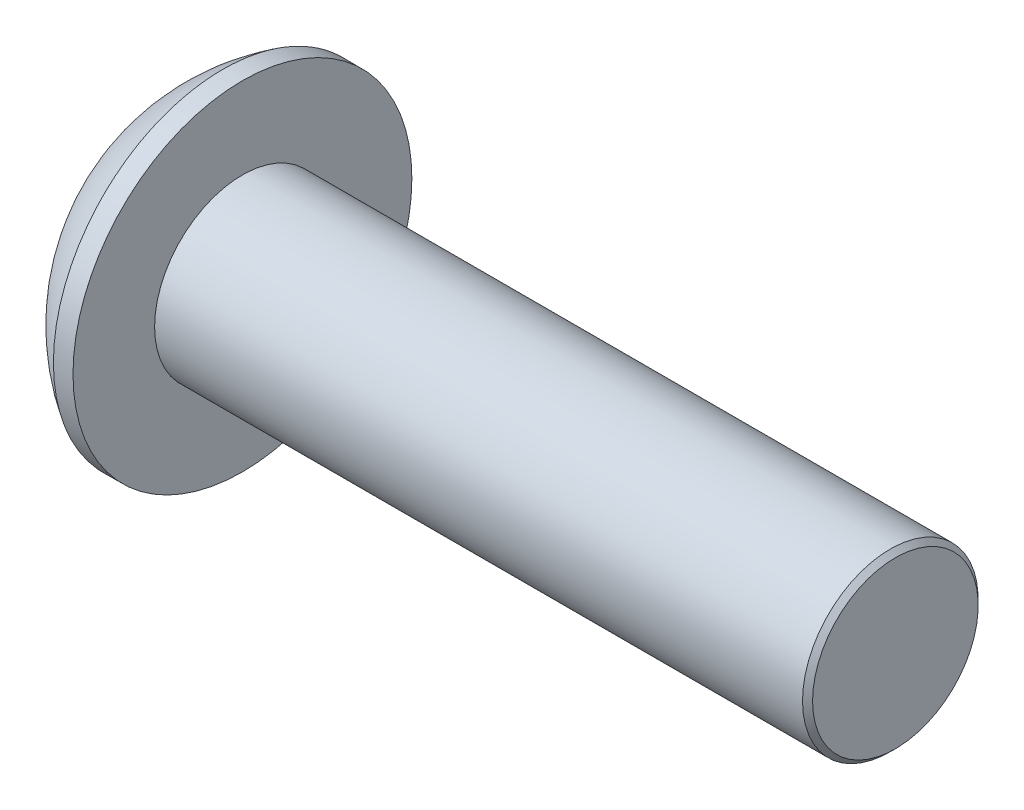
ISO-10303-21;
HEADER;
FILE_DESCRIPTION(('STEP AP214'),'2;1');
FILE_NAME('part.step','',(''),(''),'','','');
FILE_SCHEMA(('AUTOMOTIVE_DESIGN { 1 0 10303 214 1 1 1 1 }'));
ENDSEC;
DATA;
#1=APPLICATION_CONTEXT('core data for automotive mechanical design processes');
#2=APPLICATION_PROTOCOL_DEFINITION('international standard','automotive_design',2000,#1);
#3=PRODUCT_CONTEXT('',#1,'mechanical');
#4=PRODUCT('Part','Part','',(#3));
#5=PRODUCT_RELATED_PRODUCT_CATEGORY('part','',(#4));
#6=PRODUCT_DEFINITION_FORMATION('','',#4);
#7=PRODUCT_DEFINITION_CONTEXT('part definition',#1,'design');
#8=PRODUCT_DEFINITION('design','',#6,#7);
#9=PRODUCT_DEFINITION_SHAPE('','',#8);
#10=(LENGTH_UNIT() NAMED_UNIT(*) SI_UNIT(.MILLI.,.METRE.));
#11=(NAMED_UNIT(*) PLANE_ANGLE_UNIT() SI_UNIT($,.RADIAN.));
#12=(NAMED_UNIT(*) SI_UNIT($,.STERADIAN.) SOLID_ANGLE_UNIT());
#13=UNCERTAINTY_MEASURE_WITH_UNIT(LENGTH_MEASURE(1.E-05),#10,'distance_accuracy_value','');
#14=(GEOMETRIC_REPRESENTATION_CONTEXT(3) GLOBAL_UNCERTAINTY_ASSIGNED_CONTEXT((#13)) GLOBAL_UNIT_ASSIGNED_CONTEXT((#10,
#11,#12)) REPRESENTATION_CONTEXT('',''));
#15=CARTESIAN_POINT('',(0.,0.,0.));
#16=DIRECTION('',(0.,0.,1.));
#17=DIRECTION('',(1.,0.,0.));
#18=AXIS2_PLACEMENT_3D('',#15,#16,#17);
#19=CARTESIAN_POINT('',(1.32080000000034,0.,0.));
#20=DIRECTION('',(-1.,0.,0.));
#21=DIRECTION('',(0.,0.,1.));
#22=AXIS2_PLACEMENT_3D('',#19,#20,#21);
#23=CONICAL_SURFACE('',#22,1.1937999999998,1.04719755119608);
#24=CARTESIAN_POINT('',(2.01004075135902,0.,4.44089209850063E-13));
#25=VERTEX_POINT('',#24);
#26=VERTEX_LOOP('',#25);
#27=FACE_BOUND('',#26,.T.);
#28=CARTESIAN_POINT('',(1.32080000000009,0.,0.));
#29=DIRECTION('',(-1.,0.,0.));
#30=DIRECTION('',(0.,0.,1.));
#31=AXIS2_PLACEMENT_3D('',#28,#29,#30);
#32=CIRCLE('',#31,1.19380000000024);
#33=CARTESIAN_POINT('',(1.32080000000004,-1.03386112703797,0.59690000000006));
#34=VERTEX_POINT('',#33);
#35=CARTESIAN_POINT('',(1.32080000000004,0.,1.19380000000012));
#36=VERTEX_POINT('',#35);
#37=EDGE_CURVE('E19',#34,#36,#32,.T.);
#38=ORIENTED_EDGE('',*,*,#37,.T.);
#39=CARTESIAN_POINT('',(1.32080000000009,0.,0.));
#40=DIRECTION('',(-1.,0.,0.));
#41=DIRECTION('',(0.,0.,1.));
#42=AXIS2_PLACEMENT_3D('',#39,#40,#41);
#43=CIRCLE('',#42,1.19380000000024);
#44=CARTESIAN_POINT('',(1.32080000000004,1.03386112703797,0.596900000000061));
#45=VERTEX_POINT('',#44);
#46=EDGE_CURVE('E148',#36,#45,#43,.T.);
#47=ORIENTED_EDGE('',*,*,#46,.T.);
#48=CARTESIAN_POINT('',(1.32080000000009,0.,0.));
#49=DIRECTION('',(-1.,0.,0.));
#50=DIRECTION('',(0.,0.,1.));
#51=AXIS2_PLACEMENT_3D('',#48,#49,#50);
#52=CIRCLE('',#51,1.19380000000024);
#53=CARTESIAN_POINT('',(1.32080000000004,1.03386112703797,-0.596900000000061));
#54=VERTEX_POINT('',#53);
#55=EDGE_CURVE('E318',#45,#54,#52,.T.);
#56=ORIENTED_EDGE('',*,*,#55,.T.);
#57=CARTESIAN_POINT('',(1.32080000000009,0.,0.));
#58=DIRECTION('',(-1.,0.,0.));
#59=DIRECTION('',(0.,0.,1.));
#60=AXIS2_PLACEMENT_3D('',#57,#58,#59);
#61=CIRCLE('',#60,1.19380000000024);
#62=CARTESIAN_POINT('',(1.32080000000004,1.49457637585666E-12,-1.19380000000012));
#63=VERTEX_POINT('',#62);
#64=EDGE_CURVE('E319',#54,#63,#61,.T.);
#65=ORIENTED_EDGE('',*,*,#64,.T.);
#66=CARTESIAN_POINT('',(1.32080000000009,0.,0.));
#67=DIRECTION('',(-1.,0.,0.));
#68=DIRECTION('',(0.,0.,1.));
#69=AXIS2_PLACEMENT_3D('',#66,#67,#68);
#70=CIRCLE('',#69,1.19380000000024);
#71=CARTESIAN_POINT('',(1.32080000000004,-1.03386112703797,-0.59690000000006));
#72=VERTEX_POINT('',#71);
#73=EDGE_CURVE('E92',#63,#72,#70,.T.);
#74=ORIENTED_EDGE('',*,*,#73,.T.);
#75=CARTESIAN_POINT('',(1.32080000000009,0.,0.));
#76=DIRECTION('',(-1.,0.,0.));
#77=DIRECTION('',(0.,0.,1.));
#78=AXIS2_PLACEMENT_3D('',#75,#76,#77);
#79=CIRCLE('',#78,1.19380000000024);
#80=EDGE_CURVE('E88',#72,#34,#79,.T.);
#81=ORIENTED_EDGE('',*,*,#80,.T.);
#82=EDGE_LOOP('',(#38,#47,#56,#65,#74,#81));
#83=FACE_BOUND('',#82,.T.);
#84=ADVANCED_FACE('F16',(#27,#83),#23,.F.);
#85=CARTESIAN_POINT('',(1.3208,-2.06772225407572,-1.1938));
#86=DIRECTION('',(1.,0.,0.));
#87=DIRECTION('',(0.,0.,-1.));
#88=AXIS2_PLACEMENT_3D('',#85,#86,#87);
#89=PLANE('',#88);
#90=DIRECTION('',(0.,0.5,0.866025403784439));
#91=VECTOR('',#90,1.);
#92=CARTESIAN_POINT('',(1.3208,-1.37848150271715,0.));
#93=LINE('',#92,#91);
#94=CARTESIAN_POINT('',(1.3208,-0.689240751358574,1.1938));
#95=VERTEX_POINT('',#94);
#96=EDGE_CURVE('E100',#95,#34,#93,.F.);
#97=ORIENTED_EDGE('',*,*,#96,.F.);
#98=DIRECTION('',(0.,1.,0.));
#99=VECTOR('',#98,1.);
#100=CARTESIAN_POINT('',(1.3208,-0.689240751358574,1.1938));
#101=LINE('',#100,#99);
#102=EDGE_CURVE('E102',#36,#95,#101,.F.);
#103=ORIENTED_EDGE('',*,*,#102,.F.);
#104=ORIENTED_EDGE('',*,*,#37,.F.);
#105=EDGE_LOOP('',(#97,#103,#104));
#106=FACE_BOUND('',#105,.T.);
#107=ADVANCED_FACE('F98',(#106),#89,.F.);
#108=CARTESIAN_POINT('',(1.3208,-2.06772225407572,-1.1938));
#109=DIRECTION('',(1.,0.,0.));
#110=DIRECTION('',(0.,0.,-1.));
#111=AXIS2_PLACEMENT_3D('',#108,#109,#110);
#112=PLANE('',#111);
#113=DIRECTION('',(0.,-0.5,0.866025403784439));
#114=VECTOR('',#113,1.);
#115=CARTESIAN_POINT('',(1.3208,-0.689240751358574,-1.1938));
#116=LINE('',#115,#114);
#117=CARTESIAN_POINT('',(1.3208,-1.37848150271715,0.));
#118=VERTEX_POINT('',#117);
#119=EDGE_CURVE('E108',#118,#72,#116,.F.);
#120=ORIENTED_EDGE('',*,*,#119,.F.);
#121=DIRECTION('',(0.,0.5,0.866025403784439));
#122=VECTOR('',#121,1.);
#123=CARTESIAN_POINT('',(1.3208,-1.37848150271715,0.));
#124=LINE('',#123,#122);
#125=EDGE_CURVE('E105',#34,#118,#124,.F.);
#126=ORIENTED_EDGE('',*,*,#125,.F.);
#127=ORIENTED_EDGE('',*,*,#80,.F.);
#128=EDGE_LOOP('',(#120,#126,#127));
#129=FACE_BOUND('',#128,.T.);
#130=ADVANCED_FACE('F106',(#129),#112,.F.);
#131=CARTESIAN_POINT('',(1.3208,-2.06772225407572,-1.1938));
#132=DIRECTION('',(1.,0.,0.));
#133=DIRECTION('',(0.,0.,-1.));
#134=AXIS2_PLACEMENT_3D('',#131,#132,#133);
#135=PLANE('',#134);
#136=DIRECTION('',(0.,1.,0.));
#137=VECTOR('',#136,1.);
#138=CARTESIAN_POINT('',(1.3208,0.689240751358577,-1.1938));
#139=LINE('',#138,#137);
#140=CARTESIAN_POINT('',(1.3208,-0.689240751358574,-1.1938));
#141=VERTEX_POINT('',#140);
#142=EDGE_CURVE('E288',#141,#63,#139,.T.);
#143=ORIENTED_EDGE('',*,*,#142,.F.);
#144=DIRECTION('',(0.,-0.5,0.866025403784439));
#145=VECTOR('',#144,1.);
#146=CARTESIAN_POINT('',(1.3208,-0.689240751358574,-1.1938));
#147=LINE('',#146,#145);
#148=EDGE_CURVE('E300',#72,#141,#147,.F.);
#149=ORIENTED_EDGE('',*,*,#148,.F.);
#150=ORIENTED_EDGE('',*,*,#73,.F.);
#151=EDGE_LOOP('',(#143,#149,#150));
#152=FACE_BOUND('',#151,.T.);
#153=ADVANCED_FACE('F191',(#152),#135,.F.);
#154=CARTESIAN_POINT('',(1.3208,-2.06772225407572,-1.1938));
#155=DIRECTION('',(1.,0.,0.));
#156=DIRECTION('',(0.,0.,-1.));
#157=AXIS2_PLACEMENT_3D('',#154,#155,#156);
#158=PLANE('',#157);
#159=DIRECTION('',(0.,-0.5,-0.866025403784439));
#160=VECTOR('',#159,1.);
#161=CARTESIAN_POINT('',(1.3208,1.37848150271715,0.));
#162=LINE('',#161,#160);
#163=CARTESIAN_POINT('',(1.3208,0.689240751358577,-1.1938));
#164=VERTEX_POINT('',#163);
#165=EDGE_CURVE('E274',#164,#54,#162,.F.);
#166=ORIENTED_EDGE('',*,*,#165,.F.);
#167=DIRECTION('',(0.,1.,0.));
#168=VECTOR('',#167,1.);
#169=CARTESIAN_POINT('',(1.3208,0.689240751358577,-1.1938));
#170=LINE('',#169,#168);
#171=EDGE_CURVE('E285',#63,#164,#170,.T.);
#172=ORIENTED_EDGE('',*,*,#171,.F.);
#173=ORIENTED_EDGE('',*,*,#64,.F.);
#174=EDGE_LOOP('',(#166,#172,#173));
#175=FACE_BOUND('',#174,.T.);
#176=ADVANCED_FACE('F187',(#175),#158,.F.);
#177=CARTESIAN_POINT('',(1.3208,-2.06772225407572,-1.1938));
#178=DIRECTION('',(1.,0.,0.));
#179=DIRECTION('',(0.,0.,-1.));
#180=AXIS2_PLACEMENT_3D('',#177,#178,#179);
#181=PLANE('',#180);
#182=DIRECTION('',(0.,0.5,-0.866025403784439));
#183=VECTOR('',#182,1.);
#184=CARTESIAN_POINT('',(1.3208,0.689240751358576,1.1938));
#185=LINE('',#184,#183);
#186=CARTESIAN_POINT('',(1.3208,1.37848150271715,0.));
#187=VERTEX_POINT('',#186);
#188=EDGE_CURVE('E253',#187,#45,#185,.F.);
#189=ORIENTED_EDGE('',*,*,#188,.F.);
#190=DIRECTION('',(0.,-0.5,-0.866025403784439));
#191=VECTOR('',#190,1.);
#192=CARTESIAN_POINT('',(1.3208,1.37848150271715,0.));
#193=LINE('',#192,#191);
#194=EDGE_CURVE('E272',#54,#187,#193,.F.);
#195=ORIENTED_EDGE('',*,*,#194,.F.);
#196=ORIENTED_EDGE('',*,*,#55,.F.);
#197=EDGE_LOOP('',(#189,#195,#196));
#198=FACE_BOUND('',#197,.T.);
#199=ADVANCED_FACE('F183',(#198),#181,.F.);
#200=CARTESIAN_POINT('',(1.3208,-2.06772225407572,-1.1938));
#201=DIRECTION('',(1.,0.,0.));
#202=DIRECTION('',(0.,0.,-1.));
#203=AXIS2_PLACEMENT_3D('',#200,#201,#202);
#204=PLANE('',#203);
#205=DIRECTION('',(0.,1.,0.));
#206=VECTOR('',#205,1.);
#207=CARTESIAN_POINT('',(1.3208,-0.689240751358574,1.1938));
#208=LINE('',#207,#206);
#209=CARTESIAN_POINT('',(1.3208,0.689240751358576,1.1938));
#210=VERTEX_POINT('',#209);
#211=EDGE_CURVE('E117',#210,#36,#208,.F.);
#212=ORIENTED_EDGE('',*,*,#211,.F.);
#213=DIRECTION('',(0.,0.5,-0.866025403784439));
#214=VECTOR('',#213,1.);
#215=CARTESIAN_POINT('',(1.3208,0.689240751358576,1.1938));
#216=LINE('',#215,#214);
#217=EDGE_CURVE('E256',#45,#210,#216,.F.);
#218=ORIENTED_EDGE('',*,*,#217,.F.);
#219=ORIENTED_EDGE('',*,*,#46,.F.);
#220=EDGE_LOOP('',(#212,#218,#219));
#221=FACE_BOUND('',#220,.T.);
#222=ADVANCED_FACE('F179',(#221),#204,.F.);
#223=CARTESIAN_POINT('',(1.3208,-0.689240751358574,1.1938));
#224=DIRECTION('',(0.,0.,-1.));
#225=DIRECTION('',(0.,1.,0.));
#226=AXIS2_PLACEMENT_3D('',#223,#224,#225);
#227=PLANE('',#226);
#228=DIRECTION('',(0.,1.,0.));
#229=VECTOR('',#228,1.);
#230=CARTESIAN_POINT('',(0.,0.,1.1938));
#231=LINE('',#230,#229);
#232=CARTESIAN_POINT('',(0.,0.689240751358577,1.1938));
#233=VERTEX_POINT('',#232);
#234=CARTESIAN_POINT('',(0.,-0.689240751358574,1.1938));
#235=VERTEX_POINT('',#234);
#236=EDGE_CURVE('E250',#233,#235,#231,.F.);
#237=ORIENTED_EDGE('',*,*,#236,.F.);
#238=DIRECTION('',(1.,0.,0.));
#239=VECTOR('',#238,1.);
#240=CARTESIAN_POINT('',(1.3208,0.689240751358576,1.1938));
#241=LINE('',#240,#239);
#242=EDGE_CURVE('E262',#210,#233,#241,.F.);
#243=ORIENTED_EDGE('',*,*,#242,.F.);
#244=ORIENTED_EDGE('',*,*,#211,.T.);
#245=ORIENTED_EDGE('',*,*,#102,.T.);
#246=DIRECTION('',(1.,0.,0.));
#247=VECTOR('',#246,1.);
#248=CARTESIAN_POINT('',(1.3208,-0.689240751358574,1.1938));
#249=LINE('',#248,#247);
#250=EDGE_CURVE('E111',#235,#95,#249,.T.);
#251=ORIENTED_EDGE('',*,*,#250,.F.);
#252=EDGE_LOOP('',(#237,#243,#244,#245,#251));
#253=FACE_BOUND('',#252,.T.);
#254=ADVANCED_FACE('F176',(#253),#227,.T.);
#255=CARTESIAN_POINT('',(1.3208,-1.37848150271715,0.));
#256=DIRECTION('',(0.,0.866025403784439,-0.5));
#257=DIRECTION('',(0.,0.5,0.866025403784439));
#258=AXIS2_PLACEMENT_3D('',#255,#256,#257);
#259=PLANE('',#258);
#260=DIRECTION('',(0.,-0.5,-0.866025403784439));
#261=VECTOR('',#260,1.);
#262=CARTESIAN_POINT('',(0.,-0.689240751358574,1.1938));
#263=LINE('',#262,#261);
#264=CARTESIAN_POINT('',(0.,-1.37848150271715,0.));
#265=VERTEX_POINT('',#264);
#266=EDGE_CURVE('E247',#235,#265,#263,.T.);
#267=ORIENTED_EDGE('',*,*,#266,.F.);
#268=ORIENTED_EDGE('',*,*,#250,.T.);
#269=ORIENTED_EDGE('',*,*,#96,.T.);
#270=ORIENTED_EDGE('',*,*,#125,.T.);
#271=DIRECTION('',(1.,0.,0.));
#272=VECTOR('',#271,1.);
#273=CARTESIAN_POINT('',(1.3208,-1.37848150271715,0.));
#274=LINE('',#273,#272);
#275=EDGE_CURVE('E297',#265,#118,#274,.T.);
#276=ORIENTED_EDGE('',*,*,#275,.F.);
#277=EDGE_LOOP('',(#267,#268,#269,#270,#276));
#278=FACE_BOUND('',#277,.T.);
#279=ADVANCED_FACE('F115',(#278),#259,.T.);
#280=CARTESIAN_POINT('',(1.3208,-0.689240751358574,-1.1938));
#281=DIRECTION('',(0.,0.866025403784439,0.5));
#282=DIRECTION('',(0.,-0.5,0.866025403784439));
#283=AXIS2_PLACEMENT_3D('',#280,#281,#282);
#284=PLANE('',#283);
#285=DIRECTION('',(0.,0.5,-0.866025403784439));
#286=VECTOR('',#285,1.);
#287=CARTESIAN_POINT('',(0.,-1.37848150271715,0.));
#288=LINE('',#287,#286);
#289=CARTESIAN_POINT('',(0.,-0.689240751358574,-1.1938));
#290=VERTEX_POINT('',#289);
#291=EDGE_CURVE('E244',#265,#290,#288,.T.);
#292=ORIENTED_EDGE('',*,*,#291,.F.);
#293=ORIENTED_EDGE('',*,*,#275,.T.);
#294=ORIENTED_EDGE('',*,*,#119,.T.);
#295=ORIENTED_EDGE('',*,*,#148,.T.);
#296=DIRECTION('',(1.,0.,0.));
#297=VECTOR('',#296,1.);
#298=CARTESIAN_POINT('',(1.3208,-0.689240751358574,-1.1938));
#299=LINE('',#298,#297);
#300=EDGE_CURVE('E282',#290,#141,#299,.T.);
#301=ORIENTED_EDGE('',*,*,#300,.F.);
#302=EDGE_LOOP('',(#292,#293,#294,#295,#301));
#303=FACE_BOUND('',#302,.T.);
#304=ADVANCED_FACE('F169',(#303),#284,.T.);
#305=CARTESIAN_POINT('',(1.3208,0.689240751358577,-1.1938));
#306=DIRECTION('',(0.,0.,1.));
#307=DIRECTION('',(1.,0.,0.));
#308=AXIS2_PLACEMENT_3D('',#305,#306,#307);
#309=PLANE('',#308);
#310=DIRECTION('',(0.,1.,0.));
#311=VECTOR('',#310,1.);
#312=CARTESIAN_POINT('',(0.,0.,-1.1938));
#313=LINE('',#312,#311);
#314=CARTESIAN_POINT('',(0.,0.689240751358577,-1.1938));
#315=VERTEX_POINT('',#314);
#316=EDGE_CURVE('E241',#290,#315,#313,.T.);
#317=ORIENTED_EDGE('',*,*,#316,.F.);
#318=ORIENTED_EDGE('',*,*,#300,.T.);
#319=ORIENTED_EDGE('',*,*,#142,.T.);
#320=ORIENTED_EDGE('',*,*,#171,.T.);
#321=DIRECTION('',(1.,0.,0.));
#322=VECTOR('',#321,1.);
#323=CARTESIAN_POINT('',(1.3208,0.689240751358577,-1.1938));
#324=LINE('',#323,#322);
#325=EDGE_CURVE('E257',#315,#164,#324,.T.);
#326=ORIENTED_EDGE('',*,*,#325,.F.);
#327=EDGE_LOOP('',(#317,#318,#319,#320,#326));
#328=FACE_BOUND('',#327,.T.);
#329=ADVANCED_FACE('F166',(#328),#309,.T.);
#330=CARTESIAN_POINT('',(1.3208,1.37848150271715,0.));
#331=DIRECTION('',(0.,-0.866025403784439,0.5));
#332=DIRECTION('',(0.,-0.5,-0.866025403784439));
#333=AXIS2_PLACEMENT_3D('',#330,#331,#332);
#334=PLANE('',#333);
#335=DIRECTION('',(0.,0.5,0.866025403784439));
#336=VECTOR('',#335,1.);
#337=CARTESIAN_POINT('',(0.,0.689240751358577,-1.1938));
#338=LINE('',#337,#336);
#339=CARTESIAN_POINT('',(0.,1.37848150271715,0.));
#340=VERTEX_POINT('',#339);
#341=EDGE_CURVE('E238',#315,#340,#338,.T.);
#342=ORIENTED_EDGE('',*,*,#341,.F.);
#343=ORIENTED_EDGE('',*,*,#325,.T.);
#344=ORIENTED_EDGE('',*,*,#165,.T.);
#345=ORIENTED_EDGE('',*,*,#194,.T.);
#346=DIRECTION('',(1.,0.,0.));
#347=VECTOR('',#346,1.);
#348=CARTESIAN_POINT('',(1.3208,1.37848150271715,0.));
#349=LINE('',#348,#347);
#350=EDGE_CURVE('E34',#340,#187,#349,.T.);
#351=ORIENTED_EDGE('',*,*,#350,.F.);
#352=EDGE_LOOP('',(#342,#343,#344,#345,#351));
#353=FACE_BOUND('',#352,.T.);
#354=ADVANCED_FACE('F162',(#353),#334,.T.);
#355=CARTESIAN_POINT('',(1.3208,0.689240751358576,1.1938));
#356=DIRECTION('',(0.,-0.866025403784439,-0.5));
#357=DIRECTION('',(0.,0.5,-0.866025403784439));
#358=AXIS2_PLACEMENT_3D('',#355,#356,#357);
#359=PLANE('',#358);
#360=DIRECTION('',(0.,-0.5,0.866025403784439));
#361=VECTOR('',#360,1.);
#362=CARTESIAN_POINT('',(0.,1.37848150271715,0.));
#363=LINE('',#362,#361);
#364=EDGE_CURVE('E147',#340,#233,#363,.T.);
#365=ORIENTED_EDGE('',*,*,#364,.F.);
#366=ORIENTED_EDGE('',*,*,#350,.T.);
#367=ORIENTED_EDGE('',*,*,#188,.T.);
#368=ORIENTED_EDGE('',*,*,#217,.T.);
#369=ORIENTED_EDGE('',*,*,#242,.T.);
#370=EDGE_LOOP('',(#365,#366,#367,#368,#369));
#371=FACE_BOUND('',#370,.T.);
#372=ADVANCED_FACE('F158',(#371),#359,.T.);
#373=CARTESIAN_POINT('',(0.,0.,0.));
#374=DIRECTION('',(-1.,0.,0.));
#375=DIRECTION('',(0.,0.,1.));
#376=AXIS2_PLACEMENT_3D('',#373,#374,#375);
#377=PLANE('',#376);
#378=ORIENTED_EDGE('',*,*,#341,.T.);
#379=ORIENTED_EDGE('',*,*,#364,.T.);
#380=ORIENTED_EDGE('',*,*,#236,.T.);
#381=ORIENTED_EDGE('',*,*,#266,.T.);
#382=ORIENTED_EDGE('',*,*,#291,.T.);
#383=ORIENTED_EDGE('',*,*,#316,.T.);
#384=EDGE_LOOP('',(#378,#379,#380,#381,#382,#383));
#385=FACE_BOUND('',#384,.T.);
#386=CARTESIAN_POINT('',(0.,1.647825,0.));
#387=CARTESIAN_POINT('',(1.63319194702151E-13,1.64781976319874,0.092490203977753));
#388=CARTESIAN_POINT('',(1.32890083579297E-13,1.63999511633709,0.18514501432637));
#389=CARTESIAN_POINT('',(0.,1.6167119250047,0.322075808080013));
#390=CARTESIAN_POINT('',(-1.58500729597375E-13,1.60700618770234,0.36743553339636));
#391=CARTESIAN_POINT('',(1.59063479291743E-13,1.58380101865853,0.45722093569514));
#392=CARTESIAN_POINT('',(5.6924253476393E-13,1.5702985083103,0.501645823115263));
#393=CARTESIAN_POINT('',(9.37393023603841E-13,1.52428156574313,0.632817459278967));
#394=CARTESIAN_POINT('',(0.,1.48621992666366,0.717681965518643));
#395=CARTESIAN_POINT('',(0.,1.39637079695658,0.879809706624016));
#396=CARTESIAN_POINT('',(7.82184274151218E-13,1.34458278455109,0.957072652379995));
#397=CARTESIAN_POINT('',(4.86982737501784E-13,1.25777784714521,1.06558770210237));
#398=CARTESIAN_POINT('',(1.33453761487452E-13,1.22729946114794,1.10054993332365));
#399=CARTESIAN_POINT('',(-1.3289162015903E-13,1.16354004969106,1.16775237388221));
#400=CARTESIAN_POINT('',(0.,1.13026175473033,1.19999517515816));
#401=CARTESIAN_POINT('',(0.,1.02649304340867,1.29236218866442));
#402=CARTESIAN_POINT('',(0.,0.952049986714077,1.34814848277712));
#403=CARTESIAN_POINT('',(0.,0.794895196754067,1.44639825105765));
#404=CARTESIAN_POINT('',(0.,0.712183775431296,1.48886222758992));
#405=CARTESIAN_POINT('',(0.,0.540796624265731,1.55930919813143));
#406=CARTESIAN_POINT('',(0.,0.452120958135287,1.58729234680268));
#407=CARTESIAN_POINT('',(0.,0.271332331080319,1.62797191307413));
#408=CARTESIAN_POINT('',(0.,0.179219351801791,1.64066824903626));
#409=CARTESIAN_POINT('',(0.,-0.0058307702784061,1.65041748705408));
#410=CARTESIAN_POINT('',(0.,-0.0987679130800752,1.64747038910978));
#411=CARTESIAN_POINT('',(0.,-0.282830196388822,1.62601274134435));
#412=CARTESIAN_POINT('',(0.,-0.373955346570016,1.60750227463794));
#413=CARTESIAN_POINT('',(0.,-0.551796068178801,1.55545413364523));
#414=CARTESIAN_POINT('',(0.,-0.638511592498163,1.52191629885843));
#415=CARTESIAN_POINT('',(0.,-0.805120175533149,1.44072378052346));
#416=CARTESIAN_POINT('',(0.,-0.885012976819951,1.39306856461393));
#417=CARTESIAN_POINT('',(0.,-0.997912879588355,1.31211658756413));
#418=CARTESIAN_POINT('',(0.,-1.0343949246834,1.28354906167734));
#419=CARTESIAN_POINT('',(0.,-1.10486279842068,1.22341829303709));
#420=CARTESIAN_POINT('',(0.,-1.13884618403291,1.19185218578117));
#421=CARTESIAN_POINT('',(0.,-1.23657300939908,1.09305906467359));
#422=CARTESIAN_POINT('',(0.,-1.29619288399356,1.02166556658612));
#423=CARTESIAN_POINT('',(0.,-1.40258050817755,0.869876423478031));
#424=CARTESIAN_POINT('',(0.,-1.44934874627766,0.789481120793477));
#425=CARTESIAN_POINT('',(0.,-1.50889406070375,0.66387095931334));
#426=CARTESIAN_POINT('',(0.,-1.52698985473586,0.621110806760426));
#427=CARTESIAN_POINT('',(0.,-1.55950093966664,0.53426077686433));
#428=CARTESIAN_POINT('',(-1.05235362596779E-13,-1.57391920916438,0.490172008203167));
#429=CARTESIAN_POINT('',(2.10568324685354E-13,-1.61146177909579,0.356445777718595));
#430=CARTESIAN_POINT('',(1.14396658334039E-12,-1.62897899568074,0.265126085962904));
#431=CARTESIAN_POINT('',(4.347347107204E-13,-1.64174347214908,0.144386595969386));
#432=CARTESIAN_POINT('',(1.21682740895759E-13,-1.64402207668915,0.115560405797873));
#433=CARTESIAN_POINT('',(-1.21249060026839E-13,-1.6470636594012,0.0578281757252688));
#434=CARTESIAN_POINT('',(0.,-1.64782663757318,0.0289221358241775));
#435=CARTESIAN_POINT('',(1.63505268006993E-13,-1.64781976319874,-0.0924902039777536));
#436=CARTESIAN_POINT('',(1.32794566155401E-13,-1.63999511633709,-0.18514501432637));
#437=CARTESIAN_POINT('',(0.,-1.6167119250047,-0.322075808080014));
#438=CARTESIAN_POINT('',(-1.58310187784522E-13,-1.60700618770234,-0.367435533396361));
#439=CARTESIAN_POINT('',(1.58872782530651E-13,-1.58380101865853,-0.45722093569514));
#440=CARTESIAN_POINT('',(5.68527399730162E-13,-1.5702985083103,-0.501645823115263));
#441=CARTESIAN_POINT('',(9.36221934104128E-13,-1.52428156574313,-0.632817459278966));
#442=CARTESIAN_POINT('',(0.,-1.48621992666366,-0.717681965518643));
#443=CARTESIAN_POINT('',(0.,-1.39637079695658,-0.879809706624015));
#444=CARTESIAN_POINT('',(7.809853327574E-13,-1.34458278455109,-0.957072652379992));
#445=CARTESIAN_POINT('',(4.86281382838322E-13,-1.25777784714521,-1.06558770210237));
#446=CARTESIAN_POINT('',(1.33300307899813E-13,-1.22729946114794,-1.10054993332365));
#447=CARTESIAN_POINT('',(-1.32738314523763E-13,-1.16354004969107,-1.16775237388221));
#448=CARTESIAN_POINT('',(0.,-1.13026175473033,-1.19999517515816));
#449=CARTESIAN_POINT('',(0.,-1.02649304340867,-1.29236218866442));
#450=CARTESIAN_POINT('',(0.,-0.952049986714081,-1.34814848277713));
#451=CARTESIAN_POINT('',(0.,-0.794895196754072,-1.44639825105765));
#452=CARTESIAN_POINT('',(0.,-0.7121837754313,-1.48886222758991));
#453=CARTESIAN_POINT('',(0.,-0.540796624265734,-1.55930919813143));
#454=CARTESIAN_POINT('',(0.,-0.452120958135291,-1.58729234680268));
#455=CARTESIAN_POINT('',(0.,-0.271332331080322,-1.62797191307413));
#456=CARTESIAN_POINT('',(0.,-0.179219351801793,-1.64066824903626));
#457=CARTESIAN_POINT('',(0.,0.00583077027840386,-1.65041748705408));
#458=CARTESIAN_POINT('',(0.,0.0987679130800731,-1.64747038910978));
#459=CARTESIAN_POINT('',(0.,0.28283019638882,-1.62601274134436));
#460=CARTESIAN_POINT('',(0.,0.373955346570014,-1.60750227463794));
#461=CARTESIAN_POINT('',(0.,0.551796068178799,-1.55545413364523));
#462=CARTESIAN_POINT('',(0.,0.638511592498161,-1.52191629885844));
#463=CARTESIAN_POINT('',(0.,0.805120175533147,-1.44072378052347));
#464=CARTESIAN_POINT('',(0.,0.885012976819949,-1.39306856461393));
#465=CARTESIAN_POINT('',(0.,0.997912879588353,-1.31211658756413));
#466=CARTESIAN_POINT('',(0.,1.03439492468339,-1.28354906167734));
#467=CARTESIAN_POINT('',(0.,1.10486279842068,-1.22341829303709));
#468=CARTESIAN_POINT('',(0.,1.1388461840329,-1.19185218578117));
#469=CARTESIAN_POINT('',(0.,1.23657300939908,-1.09305906467358));
#470=CARTESIAN_POINT('',(0.,1.29619288399356,-1.02166556658612));
#471=CARTESIAN_POINT('',(0.,1.40258050817755,-0.869876423478032));
#472=CARTESIAN_POINT('',(0.,1.44934874627765,-0.789481120793476));
#473=CARTESIAN_POINT('',(0.,1.50889406070375,-0.66387095931334));
#474=CARTESIAN_POINT('',(0.,1.52698985473586,-0.621110806760427));
#475=CARTESIAN_POINT('',(0.,1.55950093966664,-0.534260776864331));
#476=CARTESIAN_POINT('',(-1.05163336027755E-13,1.57391920916437,-0.490172008203168));
#477=CARTESIAN_POINT('',(2.10424649207135E-13,1.61146177909579,-0.356445777718595));
#478=CARTESIAN_POINT('',(1.1439193518672E-12,1.62897899568074,-0.265126085962905));
#479=CARTESIAN_POINT('',(4.34749480231378E-13,1.64174347214908,-0.144386595969387));
#480=CARTESIAN_POINT('',(1.21707467703441E-13,1.64402207668915,-0.115560405797874));
#481=CARTESIAN_POINT('',(-1.21273786834522E-13,1.6470636594012,-0.0578281757252697));
#482=CARTESIAN_POINT('',(0.,1.64782663757318,-0.0289221358241784));
#483=CARTESIAN_POINT('',(0.,1.647825,0.));
#484=B_SPLINE_CURVE_WITH_KNOTS('',3,(#386,#387,#388,#389,#390,#391,#392,#393,#394,#395,#396,
#397,#398,#399,#400,#401,#402,#403,#404,#405,#406,#407,#408,#409,#410,#411,#412,#413,#414,#415,
#416,#417,#418,#419,#420,#421,#422,#423,#424,#425,#426,#427,#428,#429,#430,#431,#432,#433,#434,
#435,#436,#437,#438,#439,#440,#441,#442,#443,#444,#445,#446,#447,#448,#449,#450,#451,#452,#453,
#454,#455,#456,#457,#458,#459,#460,#461,#462,#463,#464,#465,#466,#467,#468,#469,#470,#471,#472,
#473,#474,#475,#476,#477,#478,#479,#480,#481,#482,#483),.UNSPECIFIED.,.T.,.F.,(4,2,2,2,2,2,2,2,
2,2,2,2,2,2,2,2,2,2,2,2,2,2,2,2,2,2,2,2,2,2,2,2,2,2,2,2,2,2,2,2,2,2,2,2,2,2,2,2,4),(0.,
0.277336029422426,0.416368541537111,0.5555141146256,0.833141970294986,1.11078038089036,
1.24978149120748,1.38864858351854,1.66629367015056,1.94392828594775,2.22155993641642,
2.49919306954937,2.77682620268234,3.05445785315101,3.3320924689482,3.6097375555799,
3.74860464789074,3.88760575820767,4.16524416880332,4.44287202447287,4.5820175975616,
4.72105010967662,4.99838613909882,5.08511046196677,5.17183478483476,5.44917081425719,
5.58820332637187,5.72734889946036,6.00497675512975,6.28261516572512,6.42161627604224,
6.5604833683533,6.83812845498532,7.11576307078251,7.39339472125118,7.67102785438413,
7.9486609875171,8.22629263798578,8.50392725378296,8.78157234041466,8.9204394327255,
9.05944054304243,9.33707895363808,9.61470680930763,9.75385238239637,9.89288489451138,
10.1702209239336,10.2569452468015,10.3436695696695),.UNSPECIFIED.);
#485=CARTESIAN_POINT('',(0.,1.647825,0.));
#486=VERTEX_POINT('',#485);
#487=EDGE_CURVE('E139',#486,#486,#484,.T.);
#488=ORIENTED_EDGE('',*,*,#487,.F.);
#489=EDGE_LOOP('',(#488));
#490=FACE_BOUND('',#489,.T.);
#491=ADVANCED_FACE('F154',(#385,#490),#377,.T.);
#492=CARTESIAN_POINT('',(3.50132362607759,0.,0.));
#493=DIRECTION('',(0.,1.,0.));
#494=DIRECTION('',(1.,0.,0.));
#495=AXIS2_PLACEMENT_3D('',#492,#493,#494);
#496=SPHERICAL_SURFACE('',#495,3.86970210289553);
#497=CARTESIAN_POINT('',(1.4732,0.,0.));
#498=DIRECTION('',(-1.,0.,0.));
#499=DIRECTION('',(0.,0.,1.));
#500=AXIS2_PLACEMENT_3D('',#497,#498,#499);
#501=CIRCLE('',#500,3.29565);
#502=CARTESIAN_POINT('',(1.4732,0.,3.29565));
#503=VERTEX_POINT('',#502);
#504=EDGE_CURVE('E136',#503,#503,#501,.F.);
#505=ORIENTED_EDGE('',*,*,#504,.F.);
#506=EDGE_LOOP('',(#505));
#507=FACE_BOUND('',#506,.T.);
#508=ORIENTED_EDGE('',*,*,#487,.T.);
#509=EDGE_LOOP('',(#508));
#510=FACE_BOUND('',#509,.T.);
#511=ADVANCED_FACE('F150',(#507,#510),#496,.T.);
#512=CARTESIAN_POINT('',(14.5542,0.,0.));
#513=DIRECTION('',(-1.,0.,0.));
#514=DIRECTION('',(0.,0.,1.));
#515=AXIS2_PLACEMENT_3D('',#512,#513,#514);
#516=PLANE('',#515);
#517=CARTESIAN_POINT('',(14.5542000000205,0.,0.));
#518=DIRECTION('',(-1.,0.,0.));
#519=DIRECTION('',(0.,0.,1.));
#520=AXIS2_PLACEMENT_3D('',#517,#518,#519);
#521=CIRCLE('',#520,1.61036000002923);
#522=CARTESIAN_POINT('',(14.5542000000205,0.,1.61036000002923));
#523=VERTEX_POINT('',#522);
#524=EDGE_CURVE('E133',#523,#523,#521,.T.);
#525=ORIENTED_EDGE('',*,*,#524,.F.);
#526=EDGE_LOOP('',(#525));
#527=FACE_BOUND('',#526,.T.);
#528=ADVANCED_FACE('F222',(#527),#516,.F.);
#529=CARTESIAN_POINT('',(0.,0.,0.));
#530=DIRECTION('',(-1.,0.,0.));
#531=DIRECTION('',(0.,0.,1.));
#532=AXIS2_PLACEMENT_3D('',#529,#530,#531);
#533=CYLINDRICAL_SURFACE('',#532,3.29565);
#534=ORIENTED_EDGE('',*,*,#504,.T.);
#535=EDGE_LOOP('',(#534));
#536=FACE_BOUND('',#535,.T.);
#537=CARTESIAN_POINT('',(1.8542,0.,0.));
#538=DIRECTION('',(-1.,0.,0.));
#539=DIRECTION('',(0.,0.,1.));
#540=AXIS2_PLACEMENT_3D('',#537,#538,#539);
#541=CIRCLE('',#540,3.29565);
#542=CARTESIAN_POINT('',(1.8542,0.,3.29565));
#543=VERTEX_POINT('',#542);
#544=EDGE_CURVE('E130',#543,#543,#541,.T.);
#545=ORIENTED_EDGE('',*,*,#544,.T.);
#546=EDGE_LOOP('',(#545));
#547=FACE_BOUND('',#546,.T.);
#548=ADVANCED_FACE('F219',(#536,#547),#533,.T.);
#549=CARTESIAN_POINT('',(14.4564100000935,0.,0.));
#550=DIRECTION('',(-1.,0.,0.));
#551=DIRECTION('',(0.,0.,1.));
#552=AXIS2_PLACEMENT_3D('',#549,#550,#551);
#553=CONICAL_SURFACE('',#552,1.70814999989943,0.785398163106808);
#554=ORIENTED_EDGE('',*,*,#524,.T.);
#555=EDGE_LOOP('',(#554));
#556=FACE_BOUND('',#555,.T.);
#557=CARTESIAN_POINT('',(14.45641,0.,0.));
#558=DIRECTION('',(-1.,0.,0.));
#559=DIRECTION('',(0.,0.,1.));
#560=AXIS2_PLACEMENT_3D('',#557,#558,#559);
#561=CIRCLE('',#560,1.70815);
#562=CARTESIAN_POINT('',(14.45641,0.,1.70815));
#563=VERTEX_POINT('',#562);
#564=EDGE_CURVE('E25',#563,#563,#561,.T.);
#565=ORIENTED_EDGE('',*,*,#564,.F.);
#566=EDGE_LOOP('',(#565));
#567=FACE_BOUND('',#566,.T.);
#568=ADVANCED_FACE('F211',(#556,#567),#553,.T.);
#569=CARTESIAN_POINT('',(1.8542,1.70815,0.));
#570=DIRECTION('',(-1.,0.,0.));
#571=DIRECTION('',(0.,0.,1.));
#572=AXIS2_PLACEMENT_3D('',#569,#570,#571);
#573=PLANE('',#572);
#574=CARTESIAN_POINT('',(1.8542,0.,0.));
#575=DIRECTION('',(-1.,0.,0.));
#576=DIRECTION('',(0.,0.,1.));
#577=AXIS2_PLACEMENT_3D('',#574,#575,#576);
#578=CIRCLE('',#577,1.70815);
#579=CARTESIAN_POINT('',(1.8542,0.,1.70815));
#580=VERTEX_POINT('',#579);
#581=EDGE_CURVE('E11',#580,#580,#578,.F.);
#582=ORIENTED_EDGE('',*,*,#581,.F.);
#583=EDGE_LOOP('',(#582));
#584=FACE_BOUND('',#583,.T.);
#585=ORIENTED_EDGE('',*,*,#544,.F.);
#586=EDGE_LOOP('',(#585));
#587=FACE_BOUND('',#586,.T.);
#588=ADVANCED_FACE('F205',(#584,#587),#573,.F.);
#589=CARTESIAN_POINT('',(0.,0.,0.));
#590=DIRECTION('',(-1.,0.,0.));
#591=DIRECTION('',(0.,0.,1.));
#592=AXIS2_PLACEMENT_3D('',#589,#590,#591);
#593=CYLINDRICAL_SURFACE('',#592,1.70815);
#594=ORIENTED_EDGE('',*,*,#564,.T.);
#595=EDGE_LOOP('',(#594));
#596=FACE_BOUND('',#595,.T.);
#597=ORIENTED_EDGE('',*,*,#581,.T.);
#598=EDGE_LOOP('',(#597));
#599=FACE_BOUND('',#598,.T.);
#600=ADVANCED_FACE('F203',(#596,#599),#593,.T.);
#601=CLOSED_SHELL('',(#84,#107,#130,#153,#176,#199,#222,#254,#279,#304,#329,#354,#372,#491,#511,
#528,#548,#568,#588,#600));
#602=MANIFOLD_SOLID_BREP('B1',#601);
#603=ADVANCED_BREP_SHAPE_REPRESENTATION('',(#18,#602),#14);
#604=SHAPE_DEFINITION_REPRESENTATION(#9,#603);
ENDSEC;
END-ISO-10303-21;
